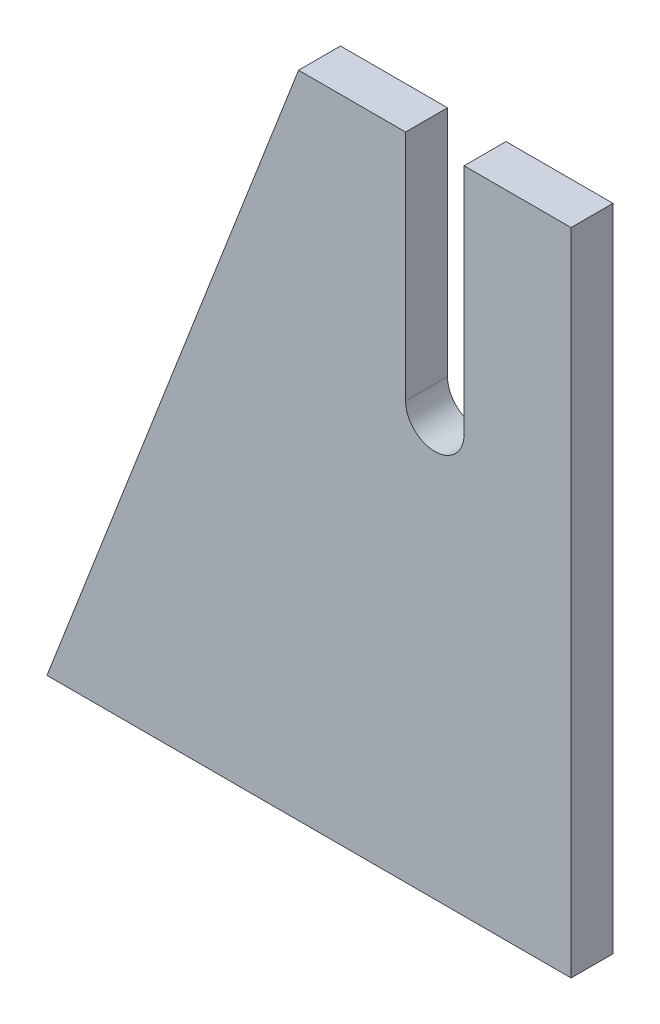
ISO-10303-21;
HEADER;
FILE_DESCRIPTION(('STEP AP214'),'2;1');
FILE_NAME('part.step','',(''),(''),'','','');
FILE_SCHEMA(('AUTOMOTIVE_DESIGN { 1 0 10303 214 1 1 1 1 }'));
ENDSEC;
DATA;
#1=APPLICATION_CONTEXT('core data for automotive mechanical design processes');
#2=APPLICATION_PROTOCOL_DEFINITION('international standard','automotive_design',2000,#1);
#3=PRODUCT_CONTEXT('',#1,'mechanical');
#4=PRODUCT('Part','Part','',(#3));
#5=PRODUCT_RELATED_PRODUCT_CATEGORY('part','',(#4));
#6=PRODUCT_DEFINITION_FORMATION('','',#4);
#7=PRODUCT_DEFINITION_CONTEXT('part definition',#1,'design');
#8=PRODUCT_DEFINITION('design','',#6,#7);
#9=PRODUCT_DEFINITION_SHAPE('','',#8);
#10=(LENGTH_UNIT() NAMED_UNIT(*) SI_UNIT(.MILLI.,.METRE.));
#11=(NAMED_UNIT(*) PLANE_ANGLE_UNIT() SI_UNIT($,.RADIAN.));
#12=(NAMED_UNIT(*) SI_UNIT($,.STERADIAN.) SOLID_ANGLE_UNIT());
#13=UNCERTAINTY_MEASURE_WITH_UNIT(LENGTH_MEASURE(1.E-05),#10,'distance_accuracy_value','');
#14=(GEOMETRIC_REPRESENTATION_CONTEXT(3) GLOBAL_UNCERTAINTY_ASSIGNED_CONTEXT((#13)) GLOBAL_UNIT_ASSIGNED_CONTEXT((#10,
#11,#12)) REPRESENTATION_CONTEXT('',''));
#15=CARTESIAN_POINT('',(0.,0.,0.));
#16=DIRECTION('',(0.,0.,1.));
#17=DIRECTION('',(1.,0.,0.));
#18=AXIS2_PLACEMENT_3D('',#15,#16,#17);
#19=CARTESIAN_POINT('',(0.,0.,4.));
#20=DIRECTION('',(-1.,0.,0.));
#21=DIRECTION('',(0.,0.,1.));
#22=AXIS2_PLACEMENT_3D('',#19,#20,#21);
#23=PLANE('',#22);
#24=DIRECTION('',(0.,1.,0.));
#25=VECTOR('',#24,1.);
#26=CARTESIAN_POINT('',(0.,0.,0.));
#27=LINE('',#26,#25);
#28=CARTESIAN_POINT('',(0.,0.,0.));
#29=VERTEX_POINT('',#28);
#30=CARTESIAN_POINT('',(0.,62.,0.));
#31=VERTEX_POINT('',#30);
#32=EDGE_CURVE('E130',#29,#31,#27,.T.);
#33=ORIENTED_EDGE('',*,*,#32,.T.);
#34=DIRECTION('',(0.,0.,-1.));
#35=VECTOR('',#34,1.);
#36=CARTESIAN_POINT('',(0.,62.,4.));
#37=LINE('',#36,#35);
#38=CARTESIAN_POINT('',(0.,62.,4.));
#39=VERTEX_POINT('',#38);
#40=EDGE_CURVE('E11',#39,#31,#37,.T.);
#41=ORIENTED_EDGE('',*,*,#40,.F.);
#42=DIRECTION('',(0.,1.,0.));
#43=VECTOR('',#42,1.);
#44=CARTESIAN_POINT('',(0.,0.,4.));
#45=LINE('',#44,#43);
#46=CARTESIAN_POINT('',(0.,0.,4.));
#47=VERTEX_POINT('',#46);
#48=EDGE_CURVE('E144',#47,#39,#45,.T.);
#49=ORIENTED_EDGE('',*,*,#48,.F.);
#50=DIRECTION('',(0.,0.,-1.));
#51=VECTOR('',#50,1.);
#52=CARTESIAN_POINT('',(0.,0.,4.));
#53=LINE('',#52,#51);
#54=EDGE_CURVE('E126',#47,#29,#53,.T.);
#55=ORIENTED_EDGE('',*,*,#54,.T.);
#56=EDGE_LOOP('',(#33,#41,#49,#55));
#57=FACE_BOUND('',#56,.T.);
#58=ADVANCED_FACE('F34',(#57),#23,.F.);
#59=CARTESIAN_POINT('',(0.,62.,4.));
#60=DIRECTION('',(0.,-1.,0.));
#61=DIRECTION('',(0.,0.,-1.));
#62=AXIS2_PLACEMENT_3D('',#59,#60,#61);
#63=PLANE('',#62);
#64=DIRECTION('',(-1.,0.,0.));
#65=VECTOR('',#64,1.);
#66=CARTESIAN_POINT('',(0.,62.,0.));
#67=LINE('',#66,#65);
#68=CARTESIAN_POINT('',(-10.21,62.,0.));
#69=VERTEX_POINT('',#68);
#70=EDGE_CURVE('E133',#31,#69,#67,.T.);
#71=ORIENTED_EDGE('',*,*,#70,.T.);
#72=DIRECTION('',(0.,0.,-1.));
#73=VECTOR('',#72,1.);
#74=CARTESIAN_POINT('',(-10.21,62.,4.));
#75=LINE('',#74,#73);
#76=CARTESIAN_POINT('',(-10.21,62.,4.));
#77=VERTEX_POINT('',#76);
#78=EDGE_CURVE('E42',#77,#69,#75,.T.);
#79=ORIENTED_EDGE('',*,*,#78,.F.);
#80=DIRECTION('',(-1.,0.,0.));
#81=VECTOR('',#80,1.);
#82=CARTESIAN_POINT('',(0.,62.,4.));
#83=LINE('',#82,#81);
#84=EDGE_CURVE('E93',#39,#77,#83,.T.);
#85=ORIENTED_EDGE('',*,*,#84,.F.);
#86=ORIENTED_EDGE('',*,*,#40,.T.);
#87=EDGE_LOOP('',(#71,#79,#85,#86));
#88=FACE_BOUND('',#87,.T.);
#89=ADVANCED_FACE('F179',(#88),#63,.F.);
#90=CARTESIAN_POINT('',(-10.21,39.79,4.));
#91=DIRECTION('',(1.,0.,0.));
#92=DIRECTION('',(0.,1.,0.));
#93=AXIS2_PLACEMENT_3D('',#90,#91,#92);
#94=PLANE('',#93);
#95=DIRECTION('',(0.,-1.,0.));
#96=VECTOR('',#95,1.);
#97=CARTESIAN_POINT('',(-10.21,39.79,0.));
#98=LINE('',#97,#96);
#99=CARTESIAN_POINT('',(-10.21,39.79,0.));
#100=VERTEX_POINT('',#99);
#101=EDGE_CURVE('E135',#69,#100,#98,.T.);
#102=ORIENTED_EDGE('',*,*,#101,.T.);
#103=DIRECTION('',(0.,0.,-1.));
#104=VECTOR('',#103,1.);
#105=CARTESIAN_POINT('',(-10.21,39.79,4.));
#106=LINE('',#105,#104);
#107=CARTESIAN_POINT('',(-10.21,39.79,4.));
#108=VERTEX_POINT('',#107);
#109=EDGE_CURVE('E151',#108,#100,#106,.T.);
#110=ORIENTED_EDGE('',*,*,#109,.F.);
#111=DIRECTION('',(0.,-1.,0.));
#112=VECTOR('',#111,1.);
#113=CARTESIAN_POINT('',(-10.21,39.79,4.));
#114=LINE('',#113,#112);
#115=EDGE_CURVE('E159',#77,#108,#114,.T.);
#116=ORIENTED_EDGE('',*,*,#115,.F.);
#117=ORIENTED_EDGE('',*,*,#78,.T.);
#118=EDGE_LOOP('',(#102,#110,#116,#117));
#119=FACE_BOUND('',#118,.T.);
#120=ADVANCED_FACE('F157',(#119),#94,.F.);
#121=CARTESIAN_POINT('',(-13.,39.79,4.));
#122=DIRECTION('',(0.,0.,-1.));
#123=DIRECTION('',(-1.,0.,0.));
#124=AXIS2_PLACEMENT_3D('',#121,#122,#123);
#125=CYLINDRICAL_SURFACE('',#124,2.79);
#126=CARTESIAN_POINT('',(-13.,39.79,0.));
#127=DIRECTION('',(0.,0.,-1.));
#128=DIRECTION('',(1.,0.,0.));
#129=AXIS2_PLACEMENT_3D('',#126,#127,#128);
#130=CIRCLE('',#129,2.79);
#131=CARTESIAN_POINT('',(-15.79,39.79,0.));
#132=VERTEX_POINT('',#131);
#133=EDGE_CURVE('E137',#100,#132,#130,.T.);
#134=ORIENTED_EDGE('',*,*,#133,.T.);
#135=DIRECTION('',(0.,0.,-1.));
#136=VECTOR('',#135,1.);
#137=CARTESIAN_POINT('',(-15.79,39.79,4.));
#138=LINE('',#137,#136);
#139=CARTESIAN_POINT('',(-15.79,39.79,4.));
#140=VERTEX_POINT('',#139);
#141=EDGE_CURVE('E148',#140,#132,#138,.T.);
#142=ORIENTED_EDGE('',*,*,#141,.F.);
#143=CARTESIAN_POINT('',(-13.,39.79,4.));
#144=DIRECTION('',(0.,0.,-1.));
#145=DIRECTION('',(1.,0.,0.));
#146=AXIS2_PLACEMENT_3D('',#143,#144,#145);
#147=CIRCLE('',#146,2.79);
#148=EDGE_CURVE('E171',#108,#140,#147,.T.);
#149=ORIENTED_EDGE('',*,*,#148,.F.);
#150=ORIENTED_EDGE('',*,*,#109,.T.);
#151=EDGE_LOOP('',(#134,#142,#149,#150));
#152=FACE_BOUND('',#151,.T.);
#153=ADVANCED_FACE('F167',(#152),#125,.F.);
#154=CARTESIAN_POINT('',(-15.79,39.79,4.));
#155=DIRECTION('',(-1.,0.,0.));
#156=DIRECTION('',(0.,-1.,0.));
#157=AXIS2_PLACEMENT_3D('',#154,#155,#156);
#158=PLANE('',#157);
#159=DIRECTION('',(0.,1.,0.));
#160=VECTOR('',#159,1.);
#161=CARTESIAN_POINT('',(-15.79,39.79,0.));
#162=LINE('',#161,#160);
#163=CARTESIAN_POINT('',(-15.79,62.,0.));
#164=VERTEX_POINT('',#163);
#165=EDGE_CURVE('E139',#132,#164,#162,.T.);
#166=ORIENTED_EDGE('',*,*,#165,.T.);
#167=DIRECTION('',(0.,0.,-1.));
#168=VECTOR('',#167,1.);
#169=CARTESIAN_POINT('',(-15.79,62.,4.));
#170=LINE('',#169,#168);
#171=CARTESIAN_POINT('',(-15.79,62.,4.));
#172=VERTEX_POINT('',#171);
#173=EDGE_CURVE('E121',#172,#164,#170,.T.);
#174=ORIENTED_EDGE('',*,*,#173,.F.);
#175=DIRECTION('',(0.,1.,0.));
#176=VECTOR('',#175,1.);
#177=CARTESIAN_POINT('',(-15.79,39.79,4.));
#178=LINE('',#177,#176);
#179=EDGE_CURVE('E112',#140,#172,#178,.T.);
#180=ORIENTED_EDGE('',*,*,#179,.F.);
#181=ORIENTED_EDGE('',*,*,#141,.T.);
#182=EDGE_LOOP('',(#166,#174,#180,#181));
#183=FACE_BOUND('',#182,.T.);
#184=ADVANCED_FACE('F170',(#183),#158,.F.);
#185=CARTESIAN_POINT('',(-15.79,62.,4.));
#186=DIRECTION('',(0.,-1.,0.));
#187=DIRECTION('',(1.,0.,0.));
#188=AXIS2_PLACEMENT_3D('',#185,#186,#187);
#189=PLANE('',#188);
#190=DIRECTION('',(-1.,0.,0.));
#191=VECTOR('',#190,1.);
#192=CARTESIAN_POINT('',(-15.79,62.,0.));
#193=LINE('',#192,#191);
#194=CARTESIAN_POINT('',(-26.,62.,0.));
#195=VERTEX_POINT('',#194);
#196=EDGE_CURVE('E120',#164,#195,#193,.T.);
#197=ORIENTED_EDGE('',*,*,#196,.T.);
#198=DIRECTION('',(0.,0.,-1.));
#199=VECTOR('',#198,1.);
#200=CARTESIAN_POINT('',(-26.,62.,4.));
#201=LINE('',#200,#199);
#202=CARTESIAN_POINT('',(-26.,62.,4.));
#203=VERTEX_POINT('',#202);
#204=EDGE_CURVE('E117',#203,#195,#201,.T.);
#205=ORIENTED_EDGE('',*,*,#204,.F.);
#206=DIRECTION('',(-1.,0.,0.));
#207=VECTOR('',#206,1.);
#208=CARTESIAN_POINT('',(-15.79,62.,4.));
#209=LINE('',#208,#207);
#210=EDGE_CURVE('E106',#172,#203,#209,.T.);
#211=ORIENTED_EDGE('',*,*,#210,.F.);
#212=ORIENTED_EDGE('',*,*,#173,.T.);
#213=EDGE_LOOP('',(#197,#205,#211,#212));
#214=FACE_BOUND('',#213,.T.);
#215=ADVANCED_FACE('F118',(#214),#189,.F.);
#216=CARTESIAN_POINT('',(-26.,62.,4.));
#217=DIRECTION('',(0.93256809827409,-0.360994102557712,0.));
#218=DIRECTION('',(0.360994102557712,0.93256809827409,0.));
#219=AXIS2_PLACEMENT_3D('',#216,#217,#218);
#220=PLANE('',#219);
#221=DIRECTION('',(-0.360994102557712,-0.932568098274089,0.));
#222=VECTOR('',#221,1.);
#223=CARTESIAN_POINT('',(-26.,62.,0.));
#224=LINE('',#223,#222);
#225=CARTESIAN_POINT('',(-50.,0.,0.));
#226=VERTEX_POINT('',#225);
#227=EDGE_CURVE('E79',#195,#226,#224,.T.);
#228=ORIENTED_EDGE('',*,*,#227,.T.);
#229=DIRECTION('',(0.,0.,-1.));
#230=VECTOR('',#229,1.);
#231=CARTESIAN_POINT('',(-50.,0.,4.));
#232=LINE('',#231,#230);
#233=CARTESIAN_POINT('',(-50.,0.,4.));
#234=VERTEX_POINT('',#233);
#235=EDGE_CURVE('E122',#234,#226,#232,.T.);
#236=ORIENTED_EDGE('',*,*,#235,.F.);
#237=DIRECTION('',(-0.360994102557712,-0.932568098274089,0.));
#238=VECTOR('',#237,1.);
#239=CARTESIAN_POINT('',(-26.,62.,4.));
#240=LINE('',#239,#238);
#241=EDGE_CURVE('E110',#203,#234,#240,.T.);
#242=ORIENTED_EDGE('',*,*,#241,.F.);
#243=ORIENTED_EDGE('',*,*,#204,.T.);
#244=EDGE_LOOP('',(#228,#236,#242,#243));
#245=FACE_BOUND('',#244,.T.);
#246=ADVANCED_FACE('F124',(#245),#220,.F.);
#247=CARTESIAN_POINT('',(0.,0.,4.));
#248=DIRECTION('',(0.,1.,0.));
#249=DIRECTION('',(0.,0.,1.));
#250=AXIS2_PLACEMENT_3D('',#247,#248,#249);
#251=PLANE('',#250);
#252=DIRECTION('',(1.,0.,0.));
#253=VECTOR('',#252,1.);
#254=CARTESIAN_POINT('',(0.,0.,0.));
#255=LINE('',#254,#253);
#256=EDGE_CURVE('E85',#226,#29,#255,.T.);
#257=ORIENTED_EDGE('',*,*,#256,.T.);
#258=ORIENTED_EDGE('',*,*,#54,.F.);
#259=DIRECTION('',(1.,0.,0.));
#260=VECTOR('',#259,1.);
#261=CARTESIAN_POINT('',(0.,0.,4.));
#262=LINE('',#261,#260);
#263=EDGE_CURVE('E50',#234,#47,#262,.T.);
#264=ORIENTED_EDGE('',*,*,#263,.F.);
#265=ORIENTED_EDGE('',*,*,#235,.T.);
#266=EDGE_LOOP('',(#257,#258,#264,#265));
#267=FACE_BOUND('',#266,.T.);
#268=ADVANCED_FACE('F195',(#267),#251,.F.);
#269=CARTESIAN_POINT('',(-13.,39.79,4.));
#270=DIRECTION('',(0.,0.,1.));
#271=DIRECTION('',(1.,0.,0.));
#272=AXIS2_PLACEMENT_3D('',#269,#270,#271);
#273=PLANE('',#272);
#274=ORIENTED_EDGE('',*,*,#48,.T.);
#275=ORIENTED_EDGE('',*,*,#84,.T.);
#276=ORIENTED_EDGE('',*,*,#115,.T.);
#277=ORIENTED_EDGE('',*,*,#148,.T.);
#278=ORIENTED_EDGE('',*,*,#179,.T.);
#279=ORIENTED_EDGE('',*,*,#210,.T.);
#280=ORIENTED_EDGE('',*,*,#241,.T.);
#281=ORIENTED_EDGE('',*,*,#263,.T.);
#282=EDGE_LOOP('',(#274,#275,#276,#277,#278,#279,#280,#281));
#283=FACE_BOUND('',#282,.T.);
#284=ADVANCED_FACE('F108',(#283),#273,.T.);
#285=CARTESIAN_POINT('',(-13.,39.79,0.));
#286=DIRECTION('',(0.,0.,1.));
#287=DIRECTION('',(1.,0.,0.));
#288=AXIS2_PLACEMENT_3D('',#285,#286,#287);
#289=PLANE('',#288);
#290=ORIENTED_EDGE('',*,*,#32,.F.);
#291=ORIENTED_EDGE('',*,*,#256,.F.);
#292=ORIENTED_EDGE('',*,*,#227,.F.);
#293=ORIENTED_EDGE('',*,*,#196,.F.);
#294=ORIENTED_EDGE('',*,*,#165,.F.);
#295=ORIENTED_EDGE('',*,*,#133,.F.);
#296=ORIENTED_EDGE('',*,*,#101,.F.);
#297=ORIENTED_EDGE('',*,*,#70,.F.);
#298=EDGE_LOOP('',(#290,#291,#292,#293,#294,#295,#296,#297));
#299=FACE_BOUND('',#298,.T.);
#300=ADVANCED_FACE('F163',(#299),#289,.F.);
#301=CLOSED_SHELL('',(#58,#89,#120,#153,#184,#215,#246,#268,#284,#300));
#302=MANIFOLD_SOLID_BREP('B2',#301);
#303=ADVANCED_BREP_SHAPE_REPRESENTATION('',(#18,#302),#14);
#304=SHAPE_DEFINITION_REPRESENTATION(#9,#303);
ENDSEC;
END-ISO-10303-21;
